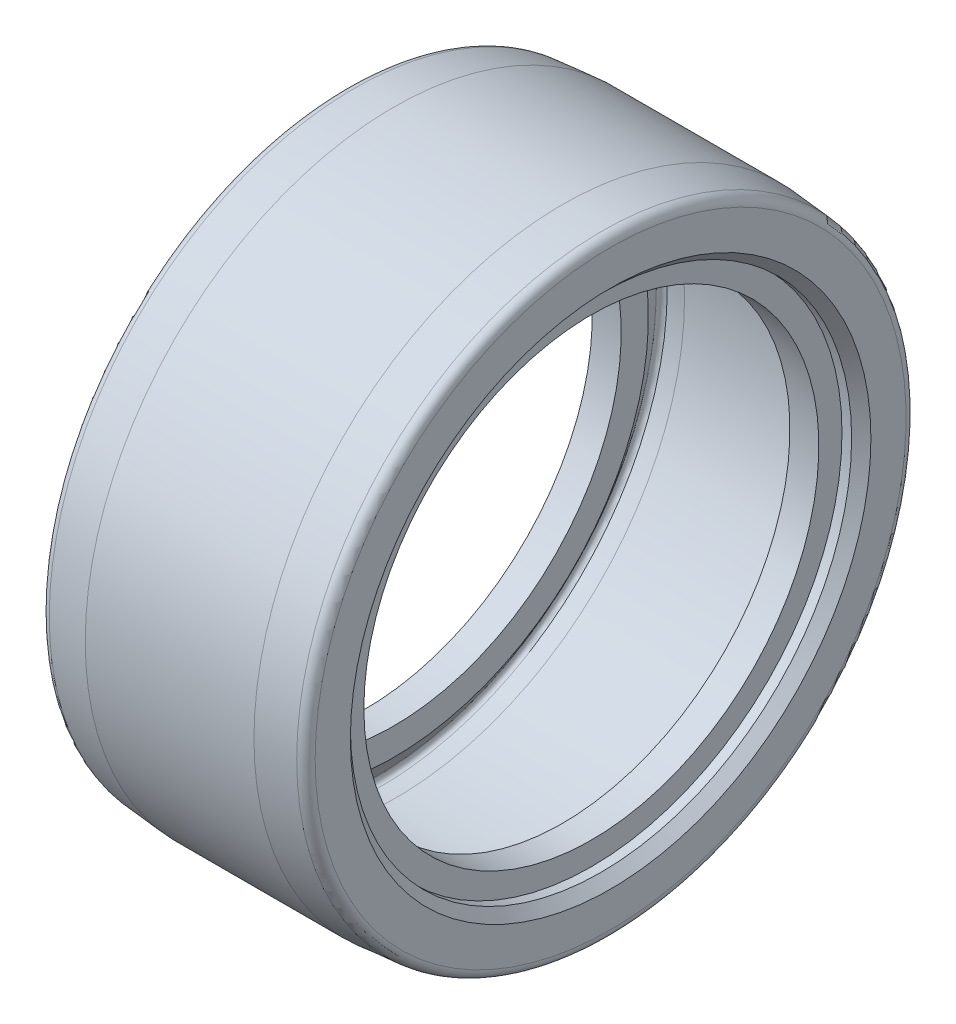
ISO-10303-21;
HEADER;
FILE_DESCRIPTION(('STEP AP214'),'2;1');
FILE_NAME('part.step','',(''),(''),'','','');
FILE_SCHEMA(('AUTOMOTIVE_DESIGN { 1 0 10303 214 1 1 1 1 }'));
ENDSEC;
DATA;
#1=APPLICATION_CONTEXT('core data for automotive mechanical design processes');
#2=APPLICATION_PROTOCOL_DEFINITION('international standard','automotive_design',2000,#1);
#3=PRODUCT_CONTEXT('',#1,'mechanical');
#4=PRODUCT('Part','Part','',(#3));
#5=PRODUCT_RELATED_PRODUCT_CATEGORY('part','',(#4));
#6=PRODUCT_DEFINITION_FORMATION('','',#4);
#7=PRODUCT_DEFINITION_CONTEXT('part definition',#1,'design');
#8=PRODUCT_DEFINITION('design','',#6,#7);
#9=PRODUCT_DEFINITION_SHAPE('','',#8);
#10=(LENGTH_UNIT() NAMED_UNIT(*) SI_UNIT(.MILLI.,.METRE.));
#11=(NAMED_UNIT(*) PLANE_ANGLE_UNIT() SI_UNIT($,.RADIAN.));
#12=(NAMED_UNIT(*) SI_UNIT($,.STERADIAN.) SOLID_ANGLE_UNIT());
#13=UNCERTAINTY_MEASURE_WITH_UNIT(LENGTH_MEASURE(1.E-05),#10,'distance_accuracy_value','');
#14=(GEOMETRIC_REPRESENTATION_CONTEXT(3) GLOBAL_UNCERTAINTY_ASSIGNED_CONTEXT((#13)) GLOBAL_UNIT_ASSIGNED_CONTEXT((#10,
#11,#12)) REPRESENTATION_CONTEXT('',''));
#15=CARTESIAN_POINT('',(0.,0.,0.));
#16=DIRECTION('',(0.,0.,1.));
#17=DIRECTION('',(1.,0.,0.));
#18=AXIS2_PLACEMENT_3D('',#15,#16,#17);
#19=CARTESIAN_POINT('',(5.00000000000004,23.6,0.));
#20=DIRECTION('',(-1.,0.,0.));
#21=DIRECTION('',(0.,0.,1.));
#22=AXIS2_PLACEMENT_3D('',#19,#20,#21);
#23=PLANE('',#22);
#24=CARTESIAN_POINT('',(5.00000000000004,0.,0.));
#25=DIRECTION('',(-1.,0.,0.));
#26=DIRECTION('',(0.,0.,1.));
#27=AXIS2_PLACEMENT_3D('',#24,#25,#26);
#28=CIRCLE('',#27,26.4221612219109);
#29=CARTESIAN_POINT('',(5.00000000000004,0.,26.4221612219109));
#30=VERTEX_POINT('',#29);
#31=EDGE_CURVE('E10',#30,#30,#28,.T.);
#32=ORIENTED_EDGE('',*,*,#31,.F.);
#33=EDGE_LOOP('',(#32));
#34=FACE_BOUND('',#33,.T.);
#35=CARTESIAN_POINT('',(5.00000000000004,0.,0.));
#36=DIRECTION('',(-1.,0.,0.));
#37=DIRECTION('',(0.,0.,1.));
#38=AXIS2_PLACEMENT_3D('',#35,#36,#37);
#39=CIRCLE('',#38,23.6);
#40=CARTESIAN_POINT('',(5.00000000000004,0.,23.6));
#41=VERTEX_POINT('',#40);
#42=EDGE_CURVE('E105',#41,#41,#39,.T.);
#43=ORIENTED_EDGE('',*,*,#42,.T.);
#44=EDGE_LOOP('',(#43));
#45=FACE_BOUND('',#44,.T.);
#46=ADVANCED_FACE('F29',(#34,#45),#23,.F.);
#47=CARTESIAN_POINT('',(5.00000000000004,0.,0.));
#48=DIRECTION('',(-1.,0.,0.));
#49=DIRECTION('',(0.,0.,1.));
#50=AXIS2_PLACEMENT_3D('',#47,#48,#49);
#51=CONICAL_SURFACE('',#50,26.4221612219109,0.961216553074876);
#52=CARTESIAN_POINT('',(3.14952210759937,0.,0.));
#53=DIRECTION('',(-1.,0.,0.));
#54=DIRECTION('',(0.,0.,1.));
#55=AXIS2_PLACEMENT_3D('',#52,#53,#54);
#56=CIRCLE('',#55,29.0721612219109);
#57=CARTESIAN_POINT('',(3.14952210759937,0.,29.0721612219109));
#58=VERTEX_POINT('',#57);
#59=EDGE_CURVE('E35',#58,#58,#56,.T.);
#60=ORIENTED_EDGE('',*,*,#59,.F.);
#61=EDGE_LOOP('',(#60));
#62=FACE_BOUND('',#61,.T.);
#63=ORIENTED_EDGE('',*,*,#31,.T.);
#64=EDGE_LOOP('',(#63));
#65=FACE_BOUND('',#64,.T.);
#66=ADVANCED_FACE('F238',(#62,#65),#51,.T.);
#67=CARTESIAN_POINT('',(3.55946644731397,0.,0.));
#68=DIRECTION('',(-1.,0.,0.));
#69=DIRECTION('',(0.,0.,1.));
#70=AXIS2_PLACEMENT_3D('',#67,#68,#69);
#71=TOROIDAL_SURFACE('',#70,29.3584227078568,0.500000000000002);
#72=CARTESIAN_POINT('',(3.51633963667996,0.,0.));
#73=DIRECTION('',(-1.,0.,0.));
#74=DIRECTION('',(0.,0.,1.));
#75=AXIS2_PLACEMENT_3D('',#72,#73,#74);
#76=CIRCLE('',#75,29.8565593138241);
#77=CARTESIAN_POINT('',(3.51633963667996,0.,29.8565593138241));
#78=VERTEX_POINT('',#77);
#79=EDGE_CURVE('E39',#78,#78,#76,.T.);
#80=ORIENTED_EDGE('',*,*,#79,.F.);
#81=EDGE_LOOP('',(#80));
#82=FACE_BOUND('',#81,.T.);
#83=ORIENTED_EDGE('',*,*,#59,.T.);
#84=EDGE_LOOP('',(#83));
#85=FACE_BOUND('',#84,.T.);
#86=ADVANCED_FACE('F233',(#82,#85),#71,.F.);
#87=CARTESIAN_POINT('',(3.51633963667996,0.,0.));
#88=DIRECTION('',(1.,0.,0.));
#89=DIRECTION('',(0.,0.,-1.));
#90=AXIS2_PLACEMENT_3D('',#87,#88,#89);
#91=CONICAL_SURFACE('',#90,29.8565593138241,0.0863609309086317);
#92=CARTESIAN_POINT('',(5.17315254537566,0.,0.));
#93=DIRECTION('',(-1.,0.,0.));
#94=DIRECTION('',(0.,0.,1.));
#95=AXIS2_PLACEMENT_3D('',#92,#93,#94);
#96=CIRCLE('',#95,30.);
#97=CARTESIAN_POINT('',(5.17315254537566,0.,30.));
#98=VERTEX_POINT('',#97);
#99=EDGE_CURVE('E43',#98,#98,#96,.T.);
#100=ORIENTED_EDGE('',*,*,#99,.F.);
#101=EDGE_LOOP('',(#100));
#102=FACE_BOUND('',#101,.T.);
#103=ORIENTED_EDGE('',*,*,#79,.T.);
#104=EDGE_LOOP('',(#103));
#105=FACE_BOUND('',#104,.T.);
#106=ADVANCED_FACE('F227',(#102,#105),#91,.F.);
#107=CARTESIAN_POINT('',(0.,0.,0.));
#108=DIRECTION('',(-1.,0.,0.));
#109=DIRECTION('',(0.,0.,1.));
#110=AXIS2_PLACEMENT_3D('',#107,#108,#109);
#111=CYLINDRICAL_SURFACE('',#110,30.);
#112=CARTESIAN_POINT('',(22.325638556484,0.,0.));
#113=DIRECTION('',(-1.,0.,0.));
#114=DIRECTION('',(0.,0.,1.));
#115=AXIS2_PLACEMENT_3D('',#112,#113,#114);
#116=CIRCLE('',#115,30.);
#117=CARTESIAN_POINT('',(22.325638556484,0.,30.));
#118=VERTEX_POINT('',#117);
#119=EDGE_CURVE('E48',#118,#118,#116,.T.);
#120=ORIENTED_EDGE('',*,*,#119,.F.);
#121=EDGE_LOOP('',(#120));
#122=FACE_BOUND('',#121,.T.);
#123=ORIENTED_EDGE('',*,*,#99,.T.);
#124=EDGE_LOOP('',(#123));
#125=FACE_BOUND('',#124,.T.);
#126=ADVANCED_FACE('F221',(#122,#125),#111,.F.);
#127=CARTESIAN_POINT('',(22.325638556484,0.,0.));
#128=DIRECTION('',(-1.,0.,0.));
#129=DIRECTION('',(0.,0.,1.));
#130=AXIS2_PLACEMENT_3D('',#127,#128,#129);
#131=CONICAL_SURFACE('',#130,30.,0.0868367027258404);
#132=CARTESIAN_POINT('',(23.9878694683771,0.,0.));
#133=DIRECTION('',(-1.,0.,0.));
#134=DIRECTION('',(0.,0.,1.));
#135=AXIS2_PLACEMENT_3D('',#132,#133,#134);
#136=CIRCLE('',#135,29.8552934400772);
#137=CARTESIAN_POINT('',(23.9878694683771,0.,29.8552934400772));
#138=VERTEX_POINT('',#137);
#139=EDGE_CURVE('E51',#138,#138,#136,.T.);
#140=ORIENTED_EDGE('',*,*,#139,.F.);
#141=EDGE_LOOP('',(#140));
#142=FACE_BOUND('',#141,.T.);
#143=ORIENTED_EDGE('',*,*,#119,.T.);
#144=EDGE_LOOP('',(#143));
#145=FACE_BOUND('',#144,.T.);
#146=ADVANCED_FACE('F215',(#142,#145),#131,.F.);
#147=CARTESIAN_POINT('',(23.9427382899971,0.,0.));
#148=DIRECTION('',(-1.,0.,0.));
#149=DIRECTION('',(0.,0.,1.));
#150=AXIS2_PLACEMENT_3D('',#147,#148,#149);
#151=TOROIDAL_SURFACE('',#150,29.3573344289749,0.500000000000016);
#152=CARTESIAN_POINT('',(24.3534404229023,0.,0.));
#153=DIRECTION('',(-1.,0.,0.));
#154=DIRECTION('',(0.,0.,1.));
#155=AXIS2_PLACEMENT_3D('',#152,#153,#154);
#156=CIRCLE('',#155,29.0721612219109);
#157=CARTESIAN_POINT('',(24.3534404229023,0.,29.0721612219109));
#158=VERTEX_POINT('',#157);
#159=EDGE_CURVE('E54',#158,#158,#156,.T.);
#160=ORIENTED_EDGE('',*,*,#159,.F.);
#161=EDGE_LOOP('',(#160));
#162=FACE_BOUND('',#161,.T.);
#163=ORIENTED_EDGE('',*,*,#139,.T.);
#164=EDGE_LOOP('',(#163));
#165=FACE_BOUND('',#164,.T.);
#166=ADVANCED_FACE('F209',(#162,#165),#151,.F.);
#167=CARTESIAN_POINT('',(24.3534404229023,0.,0.));
#168=DIRECTION('',(1.,0.,0.));
#169=DIRECTION('',(0.,0.,-1.));
#170=AXIS2_PLACEMENT_3D('',#167,#168,#169);
#171=CONICAL_SURFACE('',#170,29.0721612219109,0.960465451258843);
#172=CARTESIAN_POINT('',(22.5,0.,0.));
#173=DIRECTION('',(-1.,0.,0.));
#174=DIRECTION('',(0.,0.,1.));
#175=AXIS2_PLACEMENT_3D('',#172,#173,#174);
#176=CIRCLE('',#175,26.4221612219109);
#177=CARTESIAN_POINT('',(22.5,0.,26.4221612219109));
#178=VERTEX_POINT('',#177);
#179=EDGE_CURVE('E57',#178,#178,#176,.T.);
#180=ORIENTED_EDGE('',*,*,#179,.F.);
#181=EDGE_LOOP('',(#180));
#182=FACE_BOUND('',#181,.T.);
#183=ORIENTED_EDGE('',*,*,#159,.T.);
#184=EDGE_LOOP('',(#183));
#185=FACE_BOUND('',#184,.T.);
#186=ADVANCED_FACE('F203',(#182,#185),#171,.T.);
#187=CARTESIAN_POINT('',(22.5,23.6,0.));
#188=DIRECTION('',(1.,0.,0.));
#189=DIRECTION('',(0.,0.,-1.));
#190=AXIS2_PLACEMENT_3D('',#187,#188,#189);
#191=PLANE('',#190);
#192=CARTESIAN_POINT('',(22.5,0.,0.));
#193=DIRECTION('',(-1.,0.,0.));
#194=DIRECTION('',(0.,0.,1.));
#195=AXIS2_PLACEMENT_3D('',#192,#193,#194);
#196=CIRCLE('',#195,23.6);
#197=CARTESIAN_POINT('',(22.5,0.,23.6));
#198=VERTEX_POINT('',#197);
#199=EDGE_CURVE('E60',#198,#198,#196,.T.);
#200=ORIENTED_EDGE('',*,*,#199,.F.);
#201=EDGE_LOOP('',(#200));
#202=FACE_BOUND('',#201,.T.);
#203=ORIENTED_EDGE('',*,*,#179,.T.);
#204=EDGE_LOOP('',(#203));
#205=FACE_BOUND('',#204,.T.);
#206=ADVANCED_FACE('F197',(#202,#205),#191,.F.);
#207=CARTESIAN_POINT('',(0.,0.,0.));
#208=DIRECTION('',(-1.,0.,0.));
#209=DIRECTION('',(0.,0.,1.));
#210=AXIS2_PLACEMENT_3D('',#207,#208,#209);
#211=CYLINDRICAL_SURFACE('',#210,23.6);
#212=CARTESIAN_POINT('',(25.5,0.,0.));
#213=DIRECTION('',(-1.,0.,0.));
#214=DIRECTION('',(0.,0.,1.));
#215=AXIS2_PLACEMENT_3D('',#212,#213,#214);
#216=CIRCLE('',#215,23.6);
#217=CARTESIAN_POINT('',(25.5,0.,23.6));
#218=VERTEX_POINT('',#217);
#219=EDGE_CURVE('E63',#218,#218,#216,.T.);
#220=ORIENTED_EDGE('',*,*,#219,.F.);
#221=EDGE_LOOP('',(#220));
#222=FACE_BOUND('',#221,.T.);
#223=ORIENTED_EDGE('',*,*,#199,.T.);
#224=EDGE_LOOP('',(#223));
#225=FACE_BOUND('',#224,.T.);
#226=ADVANCED_FACE('F191',(#222,#225),#211,.F.);
#227=CARTESIAN_POINT('',(25.5,23.6,0.));
#228=DIRECTION('',(-1.,0.,0.));
#229=DIRECTION('',(0.,0.,1.));
#230=AXIS2_PLACEMENT_3D('',#227,#228,#229);
#231=PLANE('',#230);
#232=CARTESIAN_POINT('',(25.5,0.,0.));
#233=DIRECTION('',(-1.,0.,0.));
#234=DIRECTION('',(0.,0.,1.));
#235=AXIS2_PLACEMENT_3D('',#232,#233,#234);
#236=CIRCLE('',#235,26.);
#237=CARTESIAN_POINT('',(25.5,0.,26.));
#238=VERTEX_POINT('',#237);
#239=EDGE_CURVE('E66',#238,#238,#236,.T.);
#240=ORIENTED_EDGE('',*,*,#239,.F.);
#241=EDGE_LOOP('',(#240));
#242=FACE_BOUND('',#241,.T.);
#243=ORIENTED_EDGE('',*,*,#219,.T.);
#244=EDGE_LOOP('',(#243));
#245=FACE_BOUND('',#244,.T.);
#246=ADVANCED_FACE('F185',(#242,#245),#231,.F.);
#247=CARTESIAN_POINT('',(0.,0.,0.));
#248=DIRECTION('',(-1.,0.,0.));
#249=DIRECTION('',(0.,0.,1.));
#250=AXIS2_PLACEMENT_3D('',#247,#248,#249);
#251=CYLINDRICAL_SURFACE('',#250,26.);
#252=CARTESIAN_POINT('',(26.5,0.,0.));
#253=DIRECTION('',(-1.,0.,0.));
#254=DIRECTION('',(0.,0.,1.));
#255=AXIS2_PLACEMENT_3D('',#252,#253,#254);
#256=CIRCLE('',#255,26.);
#257=CARTESIAN_POINT('',(26.5,0.,26.));
#258=VERTEX_POINT('',#257);
#259=EDGE_CURVE('E69',#258,#258,#256,.T.);
#260=ORIENTED_EDGE('',*,*,#259,.F.);
#261=EDGE_LOOP('',(#260));
#262=FACE_BOUND('',#261,.T.);
#263=ORIENTED_EDGE('',*,*,#239,.T.);
#264=EDGE_LOOP('',(#263));
#265=FACE_BOUND('',#264,.T.);
#266=ADVANCED_FACE('F179',(#262,#265),#251,.F.);
#267=CARTESIAN_POINT('',(26.5,0.,0.));
#268=DIRECTION('',(1.,0.,0.));
#269=DIRECTION('',(0.,0.,-1.));
#270=AXIS2_PLACEMENT_3D('',#267,#268,#269);
#271=CONICAL_SURFACE('',#270,26.,0.785398163397448);
#272=CARTESIAN_POINT('',(27.5,0.,0.));
#273=DIRECTION('',(-1.,0.,0.));
#274=DIRECTION('',(0.,0.,1.));
#275=AXIS2_PLACEMENT_3D('',#272,#273,#274);
#276=CIRCLE('',#275,27.);
#277=CARTESIAN_POINT('',(27.5,0.,27.));
#278=VERTEX_POINT('',#277);
#279=EDGE_CURVE('E72',#278,#278,#276,.T.);
#280=ORIENTED_EDGE('',*,*,#279,.F.);
#281=EDGE_LOOP('',(#280));
#282=FACE_BOUND('',#281,.T.);
#283=ORIENTED_EDGE('',*,*,#259,.T.);
#284=EDGE_LOOP('',(#283));
#285=FACE_BOUND('',#284,.T.);
#286=ADVANCED_FACE('F173',(#282,#285),#271,.F.);
#287=CARTESIAN_POINT('',(27.5,30.65,0.));
#288=DIRECTION('',(-1.,0.,0.));
#289=DIRECTION('',(0.,0.,1.));
#290=AXIS2_PLACEMENT_3D('',#287,#288,#289);
#291=PLANE('',#290);
#292=CARTESIAN_POINT('',(27.5,0.,0.));
#293=DIRECTION('',(-1.,0.,0.));
#294=DIRECTION('',(0.,0.,1.));
#295=AXIS2_PLACEMENT_3D('',#292,#293,#294);
#296=CIRCLE('',#295,30.65);
#297=CARTESIAN_POINT('',(27.5,0.,30.65));
#298=VERTEX_POINT('',#297);
#299=EDGE_CURVE('E75',#298,#298,#296,.T.);
#300=ORIENTED_EDGE('',*,*,#299,.F.);
#301=EDGE_LOOP('',(#300));
#302=FACE_BOUND('',#301,.T.);
#303=ORIENTED_EDGE('',*,*,#279,.T.);
#304=EDGE_LOOP('',(#303));
#305=FACE_BOUND('',#304,.T.);
#306=ADVANCED_FACE('F167',(#302,#305),#291,.F.);
#307=CARTESIAN_POINT('',(26.50000722117,0.,0.));
#308=DIRECTION('',(-1.,0.,0.));
#309=DIRECTION('',(0.,0.,1.));
#310=AXIS2_PLACEMENT_3D('',#307,#308,#309);
#311=TOROIDAL_SURFACE('',#310,30.6538003010308,1.);
#312=CARTESIAN_POINT('',(26.5871057847269,0.,0.));
#313=DIRECTION('',(-1.,0.,0.));
#314=DIRECTION('',(0.,0.,1.));
#315=AXIS2_PLACEMENT_3D('',#312,#313,#314);
#316=CIRCLE('',#315,31.65);
#317=CARTESIAN_POINT('',(26.5871057847269,0.,31.65));
#318=VERTEX_POINT('',#317);
#319=EDGE_CURVE('E78',#318,#318,#316,.T.);
#320=ORIENTED_EDGE('',*,*,#319,.F.);
#321=EDGE_LOOP('',(#320));
#322=FACE_BOUND('',#321,.T.);
#323=ORIENTED_EDGE('',*,*,#299,.T.);
#324=EDGE_LOOP('',(#323));
#325=FACE_BOUND('',#324,.T.);
#326=ADVANCED_FACE('F161',(#322,#325),#311,.T.);
#327=CARTESIAN_POINT('',(26.5871057847269,0.,0.));
#328=DIRECTION('',(-1.,0.,0.));
#329=DIRECTION('',(0.,0.,1.));
#330=AXIS2_PLACEMENT_3D('',#327,#328,#329);
#331=CONICAL_SURFACE('',#330,31.65,0.0854257156606527);
#332=CARTESIAN_POINT('',(22.4999500419793,0.,0.));
#333=DIRECTION('',(-1.,0.,0.));
#334=DIRECTION('',(0.,0.,1.));
#335=AXIS2_PLACEMENT_3D('',#332,#333,#334);
#336=CIRCLE('',#335,32.);
#337=CARTESIAN_POINT('',(22.4999500419793,0.,32.));
#338=VERTEX_POINT('',#337);
#339=EDGE_CURVE('E81',#338,#338,#336,.T.);
#340=ORIENTED_EDGE('',*,*,#339,.F.);
#341=EDGE_LOOP('',(#340));
#342=FACE_BOUND('',#341,.T.);
#343=ORIENTED_EDGE('',*,*,#319,.T.);
#344=EDGE_LOOP('',(#343));
#345=FACE_BOUND('',#344,.T.);
#346=ADVANCED_FACE('F155',(#342,#345),#331,.T.);
#347=CARTESIAN_POINT('',(0.,0.,0.));
#348=DIRECTION('',(-1.,0.,0.));
#349=DIRECTION('',(0.,0.,1.));
#350=AXIS2_PLACEMENT_3D('',#347,#348,#349);
#351=CYLINDRICAL_SURFACE('',#350,32.);
#352=CARTESIAN_POINT('',(5.00000000000004,0.,0.));
#353=DIRECTION('',(-1.,0.,0.));
#354=DIRECTION('',(0.,0.,1.));
#355=AXIS2_PLACEMENT_3D('',#352,#353,#354);
#356=CIRCLE('',#355,32.);
#357=CARTESIAN_POINT('',(5.00000000000004,0.,32.));
#358=VERTEX_POINT('',#357);
#359=EDGE_CURVE('E84',#358,#358,#356,.T.);
#360=ORIENTED_EDGE('',*,*,#359,.F.);
#361=EDGE_LOOP('',(#360));
#362=FACE_BOUND('',#361,.T.);
#363=ORIENTED_EDGE('',*,*,#339,.T.);
#364=EDGE_LOOP('',(#363));
#365=FACE_BOUND('',#364,.T.);
#366=ADVANCED_FACE('F149',(#362,#365),#351,.T.);
#367=CARTESIAN_POINT('',(5.00000000000004,0.,0.));
#368=DIRECTION('',(1.,0.,0.));
#369=DIRECTION('',(0.,0.,-1.));
#370=AXIS2_PLACEMENT_3D('',#367,#368,#369);
#371=CONICAL_SURFACE('',#370,32.,0.0863609309086274);
#372=CARTESIAN_POINT('',(0.913700729771413,0.,0.));
#373=DIRECTION('',(-1.,0.,0.));
#374=DIRECTION('',(0.,0.,1.));
#375=AXIS2_PLACEMENT_3D('',#372,#373,#374);
#376=CIRCLE('',#375,31.6462234400966);
#377=CARTESIAN_POINT('',(0.913700729771413,0.,31.6462234400966));
#378=VERTEX_POINT('',#377);
#379=EDGE_CURVE('E87',#378,#378,#376,.T.);
#380=ORIENTED_EDGE('',*,*,#379,.F.);
#381=EDGE_LOOP('',(#380));
#382=FACE_BOUND('',#381,.T.);
#383=ORIENTED_EDGE('',*,*,#359,.T.);
#384=EDGE_LOOP('',(#383));
#385=FACE_BOUND('',#384,.T.);
#386=ADVANCED_FACE('F143',(#382,#385),#371,.T.);
#387=CARTESIAN_POINT('',(0.999950041979228,0.,0.));
#388=DIRECTION('',(-1.,0.,0.));
#389=DIRECTION('',(0.,0.,1.));
#390=AXIS2_PLACEMENT_3D('',#387,#388,#389);
#391=TOROIDAL_SURFACE('',#390,30.65,0.999950041979229);
#392=CARTESIAN_POINT('',(0.,0.,0.));
#393=DIRECTION('',(-1.,0.,0.));
#394=DIRECTION('',(0.,0.,1.));
#395=AXIS2_PLACEMENT_3D('',#392,#393,#394);
#396=CIRCLE('',#395,30.65);
#397=CARTESIAN_POINT('',(0.,0.,30.65));
#398=VERTEX_POINT('',#397);
#399=EDGE_CURVE('E90',#398,#398,#396,.T.);
#400=ORIENTED_EDGE('',*,*,#399,.F.);
#401=EDGE_LOOP('',(#400));
#402=FACE_BOUND('',#401,.T.);
#403=ORIENTED_EDGE('',*,*,#379,.T.);
#404=EDGE_LOOP('',(#403));
#405=FACE_BOUND('',#404,.T.);
#406=ADVANCED_FACE('F137',(#402,#405),#391,.T.);
#407=CARTESIAN_POINT('',(0.,30.65,0.));
#408=DIRECTION('',(1.,0.,0.));
#409=DIRECTION('',(0.,0.,-1.));
#410=AXIS2_PLACEMENT_3D('',#407,#408,#409);
#411=PLANE('',#410);
#412=CARTESIAN_POINT('',(0.,0.,0.));
#413=DIRECTION('',(-1.,0.,0.));
#414=DIRECTION('',(0.,0.,1.));
#415=AXIS2_PLACEMENT_3D('',#412,#413,#414);
#416=CIRCLE('',#415,27.);
#417=CARTESIAN_POINT('',(0.,0.,27.));
#418=VERTEX_POINT('',#417);
#419=EDGE_CURVE('E93',#418,#418,#416,.T.);
#420=ORIENTED_EDGE('',*,*,#419,.F.);
#421=EDGE_LOOP('',(#420));
#422=FACE_BOUND('',#421,.T.);
#423=ORIENTED_EDGE('',*,*,#399,.T.);
#424=EDGE_LOOP('',(#423));
#425=FACE_BOUND('',#424,.T.);
#426=ADVANCED_FACE('F131',(#422,#425),#411,.F.);
#427=CARTESIAN_POINT('',(0.,0.,0.));
#428=DIRECTION('',(-1.,0.,0.));
#429=DIRECTION('',(0.,0.,1.));
#430=AXIS2_PLACEMENT_3D('',#427,#428,#429);
#431=CONICAL_SURFACE('',#430,27.,0.785398163397428);
#432=CARTESIAN_POINT('',(1.00000000000005,0.,0.));
#433=DIRECTION('',(-1.,0.,0.));
#434=DIRECTION('',(0.,0.,1.));
#435=AXIS2_PLACEMENT_3D('',#432,#433,#434);
#436=CIRCLE('',#435,26.);
#437=CARTESIAN_POINT('',(1.00000000000005,0.,26.));
#438=VERTEX_POINT('',#437);
#439=EDGE_CURVE('E96',#438,#438,#436,.T.);
#440=ORIENTED_EDGE('',*,*,#439,.F.);
#441=EDGE_LOOP('',(#440));
#442=FACE_BOUND('',#441,.T.);
#443=ORIENTED_EDGE('',*,*,#419,.T.);
#444=EDGE_LOOP('',(#443));
#445=FACE_BOUND('',#444,.T.);
#446=ADVANCED_FACE('F125',(#442,#445),#431,.F.);
#447=CARTESIAN_POINT('',(0.,0.,0.));
#448=DIRECTION('',(-1.,0.,0.));
#449=DIRECTION('',(0.,0.,1.));
#450=AXIS2_PLACEMENT_3D('',#447,#448,#449);
#451=CYLINDRICAL_SURFACE('',#450,26.);
#452=CARTESIAN_POINT('',(2.00000000000005,0.,0.));
#453=DIRECTION('',(-1.,0.,0.));
#454=DIRECTION('',(0.,0.,1.));
#455=AXIS2_PLACEMENT_3D('',#452,#453,#454);
#456=CIRCLE('',#455,26.);
#457=CARTESIAN_POINT('',(2.00000000000005,0.,26.));
#458=VERTEX_POINT('',#457);
#459=EDGE_CURVE('E99',#458,#458,#456,.T.);
#460=ORIENTED_EDGE('',*,*,#459,.F.);
#461=EDGE_LOOP('',(#460));
#462=FACE_BOUND('',#461,.T.);
#463=ORIENTED_EDGE('',*,*,#439,.T.);
#464=EDGE_LOOP('',(#463));
#465=FACE_BOUND('',#464,.T.);
#466=ADVANCED_FACE('F119',(#462,#465),#451,.F.);
#467=CARTESIAN_POINT('',(2.00000000000005,23.6,0.));
#468=DIRECTION('',(1.,0.,0.));
#469=DIRECTION('',(0.,0.,-1.));
#470=AXIS2_PLACEMENT_3D('',#467,#468,#469);
#471=PLANE('',#470);
#472=CARTESIAN_POINT('',(2.00000000000005,0.,0.));
#473=DIRECTION('',(-1.,0.,0.));
#474=DIRECTION('',(0.,0.,1.));
#475=AXIS2_PLACEMENT_3D('',#472,#473,#474);
#476=CIRCLE('',#475,23.6);
#477=CARTESIAN_POINT('',(2.00000000000005,0.,23.6));
#478=VERTEX_POINT('',#477);
#479=EDGE_CURVE('E102',#478,#478,#476,.T.);
#480=ORIENTED_EDGE('',*,*,#479,.F.);
#481=EDGE_LOOP('',(#480));
#482=FACE_BOUND('',#481,.T.);
#483=ORIENTED_EDGE('',*,*,#459,.T.);
#484=EDGE_LOOP('',(#483));
#485=FACE_BOUND('',#484,.T.);
#486=ADVANCED_FACE('F113',(#482,#485),#471,.F.);
#487=CARTESIAN_POINT('',(0.,0.,0.));
#488=DIRECTION('',(-1.,0.,0.));
#489=DIRECTION('',(0.,0.,1.));
#490=AXIS2_PLACEMENT_3D('',#487,#488,#489);
#491=CYLINDRICAL_SURFACE('',#490,23.6);
#492=ORIENTED_EDGE('',*,*,#42,.F.);
#493=EDGE_LOOP('',(#492));
#494=FACE_BOUND('',#493,.T.);
#495=ORIENTED_EDGE('',*,*,#479,.T.);
#496=EDGE_LOOP('',(#495));
#497=FACE_BOUND('',#496,.T.);
#498=ADVANCED_FACE('F110',(#494,#497),#491,.F.);
#499=CLOSED_SHELL('',(#46,#66,#86,#106,#126,#146,#166,#186,#206,#226,#246,#266,#286,#306,#326,
#346,#366,#386,#406,#426,#446,#466,#486,#498));
#500=MANIFOLD_SOLID_BREP('B2',#499);
#501=ADVANCED_BREP_SHAPE_REPRESENTATION('',(#18,#500),#14);
#502=SHAPE_DEFINITION_REPRESENTATION(#9,#501);
ENDSEC;
END-ISO-10303-21;
